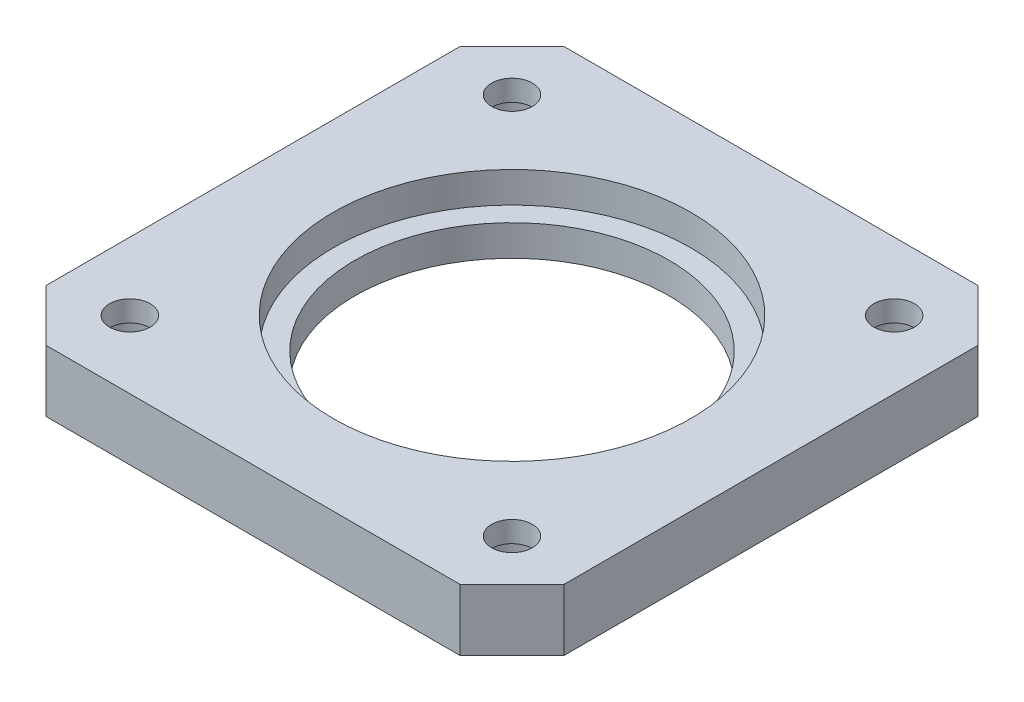
ISO-10303-21;
HEADER;
FILE_DESCRIPTION(('STEP AP214'),'2;1');
FILE_NAME('part.step','',(''),(''),'','','');
FILE_SCHEMA(('AUTOMOTIVE_DESIGN { 1 0 10303 214 1 1 1 1 }'));
ENDSEC;
DATA;
#1=APPLICATION_CONTEXT('core data for automotive mechanical design processes');
#2=APPLICATION_PROTOCOL_DEFINITION('international standard','automotive_design',2000,#1);
#3=PRODUCT_CONTEXT('',#1,'mechanical');
#4=PRODUCT('Part','Part','',(#3));
#5=PRODUCT_RELATED_PRODUCT_CATEGORY('part','',(#4));
#6=PRODUCT_DEFINITION_FORMATION('','',#4);
#7=PRODUCT_DEFINITION_CONTEXT('part definition',#1,'design');
#8=PRODUCT_DEFINITION('design','',#6,#7);
#9=PRODUCT_DEFINITION_SHAPE('','',#8);
#10=(LENGTH_UNIT() NAMED_UNIT(*) SI_UNIT(.MILLI.,.METRE.));
#11=(NAMED_UNIT(*) PLANE_ANGLE_UNIT() SI_UNIT($,.RADIAN.));
#12=(NAMED_UNIT(*) SI_UNIT($,.STERADIAN.) SOLID_ANGLE_UNIT());
#13=UNCERTAINTY_MEASURE_WITH_UNIT(LENGTH_MEASURE(1.E-05),#10,'distance_accuracy_value','');
#14=(GEOMETRIC_REPRESENTATION_CONTEXT(3) GLOBAL_UNCERTAINTY_ASSIGNED_CONTEXT((#13)) GLOBAL_UNIT_ASSIGNED_CONTEXT((#10,
#11,#12)) REPRESENTATION_CONTEXT('',''));
#15=CARTESIAN_POINT('',(0.,0.,0.));
#16=DIRECTION('',(0.,0.,1.));
#17=DIRECTION('',(1.,0.,0.));
#18=AXIS2_PLACEMENT_3D('',#15,#16,#17);
#19=CARTESIAN_POINT('',(5.5,5.,-5.5));
#20=DIRECTION('',(0.,-1.,0.));
#21=DIRECTION('',(0.,0.,-1.));
#22=AXIS2_PLACEMENT_3D('',#19,#20,#21);
#23=CYLINDRICAL_SURFACE('',#22,1.65);
#24=CARTESIAN_POINT('',(5.5,5.,-5.5));
#25=DIRECTION('',(0.,1.,0.));
#26=DIRECTION('',(0.,0.,1.));
#27=AXIS2_PLACEMENT_3D('',#24,#25,#26);
#28=CIRCLE('',#27,1.65);
#29=CARTESIAN_POINT('',(5.5,5.,-3.85));
#30=VERTEX_POINT('',#29);
#31=EDGE_CURVE('E235',#30,#30,#28,.T.);
#32=ORIENTED_EDGE('',*,*,#31,.T.);
#33=EDGE_LOOP('',(#32));
#34=FACE_BOUND('',#33,.T.);
#35=CARTESIAN_POINT('',(5.5,3.3,-5.5));
#36=DIRECTION('',(0.,-1.,0.));
#37=DIRECTION('',(0.,0.,-1.));
#38=AXIS2_PLACEMENT_3D('',#35,#36,#37);
#39=CIRCLE('',#38,1.65);
#40=CARTESIAN_POINT('',(5.5,3.3,-7.15));
#41=VERTEX_POINT('',#40);
#42=EDGE_CURVE('E44',#41,#41,#39,.T.);
#43=ORIENTED_EDGE('',*,*,#42,.T.);
#44=EDGE_LOOP('',(#43));
#45=FACE_BOUND('',#44,.T.);
#46=ADVANCED_FACE('F39',(#34,#45),#23,.F.);
#47=CARTESIAN_POINT('',(36.5,5.,-5.5));
#48=DIRECTION('',(0.,-1.,0.));
#49=DIRECTION('',(0.,0.,-1.));
#50=AXIS2_PLACEMENT_3D('',#47,#48,#49);
#51=CYLINDRICAL_SURFACE('',#50,1.65);
#52=CARTESIAN_POINT('',(36.5,5.,-5.5));
#53=DIRECTION('',(0.,1.,0.));
#54=DIRECTION('',(0.,0.,1.));
#55=AXIS2_PLACEMENT_3D('',#52,#53,#54);
#56=CIRCLE('',#55,1.65);
#57=CARTESIAN_POINT('',(36.5,5.,-3.85));
#58=VERTEX_POINT('',#57);
#59=EDGE_CURVE('E232',#58,#58,#56,.T.);
#60=ORIENTED_EDGE('',*,*,#59,.T.);
#61=EDGE_LOOP('',(#60));
#62=FACE_BOUND('',#61,.T.);
#63=CARTESIAN_POINT('',(36.5,3.3,-5.5));
#64=DIRECTION('',(0.,-1.,0.));
#65=DIRECTION('',(0.,0.,-1.));
#66=AXIS2_PLACEMENT_3D('',#63,#64,#65);
#67=CIRCLE('',#66,1.65);
#68=CARTESIAN_POINT('',(36.5,3.3,-7.15));
#69=VERTEX_POINT('',#68);
#70=EDGE_CURVE('E200',#69,#69,#67,.T.);
#71=ORIENTED_EDGE('',*,*,#70,.T.);
#72=EDGE_LOOP('',(#71));
#73=FACE_BOUND('',#72,.T.);
#74=ADVANCED_FACE('F268',(#62,#73),#51,.F.);
#75=CARTESIAN_POINT('',(36.4999999999999,5.,-36.5));
#76=DIRECTION('',(0.,-1.,0.));
#77=DIRECTION('',(0.,0.,-1.));
#78=AXIS2_PLACEMENT_3D('',#75,#76,#77);
#79=CYLINDRICAL_SURFACE('',#78,1.65);
#80=CARTESIAN_POINT('',(36.4999999999999,5.,-36.5));
#81=DIRECTION('',(0.,1.,0.));
#82=DIRECTION('',(0.,0.,1.));
#83=AXIS2_PLACEMENT_3D('',#80,#81,#82);
#84=CIRCLE('',#83,1.65);
#85=CARTESIAN_POINT('',(36.4999999999999,5.,-34.85));
#86=VERTEX_POINT('',#85);
#87=EDGE_CURVE('E229',#86,#86,#84,.T.);
#88=ORIENTED_EDGE('',*,*,#87,.T.);
#89=EDGE_LOOP('',(#88));
#90=FACE_BOUND('',#89,.T.);
#91=CARTESIAN_POINT('',(36.4999999999999,3.3,-36.5));
#92=DIRECTION('',(0.,-1.,0.));
#93=DIRECTION('',(0.,0.,-1.));
#94=AXIS2_PLACEMENT_3D('',#91,#92,#93);
#95=CIRCLE('',#94,1.65);
#96=CARTESIAN_POINT('',(36.4999999999999,3.3,-38.15));
#97=VERTEX_POINT('',#96);
#98=EDGE_CURVE('E197',#97,#97,#95,.T.);
#99=ORIENTED_EDGE('',*,*,#98,.T.);
#100=EDGE_LOOP('',(#99));
#101=FACE_BOUND('',#100,.T.);
#102=ADVANCED_FACE('F275',(#90,#101),#79,.F.);
#103=CARTESIAN_POINT('',(5.49999999999988,5.,-36.5));
#104=DIRECTION('',(0.,-1.,0.));
#105=DIRECTION('',(0.,0.,-1.));
#106=AXIS2_PLACEMENT_3D('',#103,#104,#105);
#107=CYLINDRICAL_SURFACE('',#106,1.65);
#108=CARTESIAN_POINT('',(5.49999999999988,5.,-36.5));
#109=DIRECTION('',(0.,1.,0.));
#110=DIRECTION('',(0.,0.,1.));
#111=AXIS2_PLACEMENT_3D('',#108,#109,#110);
#112=CIRCLE('',#111,1.65);
#113=CARTESIAN_POINT('',(5.49999999999988,5.,-34.85));
#114=VERTEX_POINT('',#113);
#115=EDGE_CURVE('E226',#114,#114,#112,.T.);
#116=ORIENTED_EDGE('',*,*,#115,.T.);
#117=EDGE_LOOP('',(#116));
#118=FACE_BOUND('',#117,.T.);
#119=CARTESIAN_POINT('',(5.49999999999988,3.3,-36.5));
#120=DIRECTION('',(0.,-1.,0.));
#121=DIRECTION('',(0.,0.,-1.));
#122=AXIS2_PLACEMENT_3D('',#119,#120,#121);
#123=CIRCLE('',#122,1.65);
#124=CARTESIAN_POINT('',(5.49999999999988,3.3,-38.15));
#125=VERTEX_POINT('',#124);
#126=EDGE_CURVE('E194',#125,#125,#123,.T.);
#127=ORIENTED_EDGE('',*,*,#126,.T.);
#128=EDGE_LOOP('',(#127));
#129=FACE_BOUND('',#128,.T.);
#130=ADVANCED_FACE('F347',(#118,#129),#107,.F.);
#131=CARTESIAN_POINT('',(21.,5.,-21.));
#132=DIRECTION('',(0.,-1.,0.));
#133=DIRECTION('',(0.,0.,-1.));
#134=AXIS2_PLACEMENT_3D('',#131,#132,#133);
#135=CYLINDRICAL_SURFACE('',#134,12.75);
#136=CARTESIAN_POINT('',(21.,0.,-21.));
#137=DIRECTION('',(0.,1.,0.));
#138=DIRECTION('',(0.,0.,1.));
#139=AXIS2_PLACEMENT_3D('',#136,#137,#138);
#140=CIRCLE('',#139,12.75);
#141=CARTESIAN_POINT('',(21.,0.,-8.24999999999999));
#142=VERTEX_POINT('',#141);
#143=EDGE_CURVE('E148',#142,#142,#140,.T.);
#144=ORIENTED_EDGE('',*,*,#143,.F.);
#145=EDGE_LOOP('',(#144));
#146=FACE_BOUND('',#145,.T.);
#147=CARTESIAN_POINT('',(21.,2.5,-21.));
#148=DIRECTION('',(0.,1.,0.));
#149=DIRECTION('',(0.,0.,1.));
#150=AXIS2_PLACEMENT_3D('',#147,#148,#149);
#151=CIRCLE('',#150,12.75);
#152=CARTESIAN_POINT('',(21.,2.5,-8.24999999999999));
#153=VERTEX_POINT('',#152);
#154=EDGE_CURVE('E145',#153,#153,#151,.T.);
#155=ORIENTED_EDGE('',*,*,#154,.T.);
#156=EDGE_LOOP('',(#155));
#157=FACE_BOUND('',#156,.T.);
#158=ADVANCED_FACE('F282',(#146,#157),#135,.F.);
#159=CARTESIAN_POINT('',(0.,5.,0.));
#160=DIRECTION('',(0.,-1.,0.));
#161=DIRECTION('',(0.,0.,-1.));
#162=AXIS2_PLACEMENT_3D('',#159,#160,#161);
#163=PLANE('',#162);
#164=CARTESIAN_POINT('',(21.,5.,-21.));
#165=DIRECTION('',(0.,1.,0.));
#166=DIRECTION('',(0.,0.,1.));
#167=AXIS2_PLACEMENT_3D('',#164,#165,#166);
#168=CIRCLE('',#167,14.5);
#169=CARTESIAN_POINT('',(21.,5.,-6.49999999999999));
#170=VERTEX_POINT('',#169);
#171=EDGE_CURVE('E220',#170,#170,#168,.T.);
#172=ORIENTED_EDGE('',*,*,#171,.F.);
#173=EDGE_LOOP('',(#172));
#174=FACE_BOUND('',#173,.T.);
#175=DIRECTION('',(0.,0.,-1.));
#176=VECTOR('',#175,1.);
#177=CARTESIAN_POINT('',(42.,5.,0.));
#178=LINE('',#177,#176);
#179=CARTESIAN_POINT('',(42.,5.,-4.2));
#180=VERTEX_POINT('',#179);
#181=CARTESIAN_POINT('',(42.,5.,-37.8));
#182=VERTEX_POINT('',#181);
#183=EDGE_CURVE('E240',#180,#182,#178,.T.);
#184=ORIENTED_EDGE('',*,*,#183,.T.);
#185=DIRECTION('',(0.707106781186546,0.,0.707106781186549));
#186=VECTOR('',#185,1.);
#187=CARTESIAN_POINT('',(37.8,5.,-42.));
#188=LINE('',#187,#186);
#189=CARTESIAN_POINT('',(37.8,5.,-42.));
#190=VERTEX_POINT('',#189);
#191=EDGE_CURVE('E163',#182,#190,#188,.F.);
#192=ORIENTED_EDGE('',*,*,#191,.T.);
#193=DIRECTION('',(-1.,0.,0.));
#194=VECTOR('',#193,1.);
#195=CARTESIAN_POINT('',(0.,5.,-42.));
#196=LINE('',#195,#194);
#197=CARTESIAN_POINT('',(4.20000000000002,5.,-42.));
#198=VERTEX_POINT('',#197);
#199=EDGE_CURVE('E129',#190,#198,#196,.T.);
#200=ORIENTED_EDGE('',*,*,#199,.T.);
#201=DIRECTION('',(0.707106781186549,0.,-0.707106781186546));
#202=VECTOR('',#201,1.);
#203=CARTESIAN_POINT('',(0.,5.,-37.8));
#204=LINE('',#203,#202);
#205=CARTESIAN_POINT('',(0.,5.,-37.8));
#206=VERTEX_POINT('',#205);
#207=EDGE_CURVE('E161',#198,#206,#204,.F.);
#208=ORIENTED_EDGE('',*,*,#207,.T.);
#209=DIRECTION('',(0.,0.,1.));
#210=VECTOR('',#209,1.);
#211=CARTESIAN_POINT('',(0.,5.,0.));
#212=LINE('',#211,#210);
#213=CARTESIAN_POINT('',(0.,5.,-4.20000000000001));
#214=VERTEX_POINT('',#213);
#215=EDGE_CURVE('E136',#206,#214,#212,.T.);
#216=ORIENTED_EDGE('',*,*,#215,.T.);
#217=DIRECTION('',(-0.707106781186546,0.,-0.707106781186549));
#218=VECTOR('',#217,1.);
#219=CARTESIAN_POINT('',(4.2,5.,0.));
#220=LINE('',#219,#218);
#221=CARTESIAN_POINT('',(4.2,5.,0.));
#222=VERTEX_POINT('',#221);
#223=EDGE_CURVE('E64',#214,#222,#220,.F.);
#224=ORIENTED_EDGE('',*,*,#223,.T.);
#225=DIRECTION('',(1.,0.,0.));
#226=VECTOR('',#225,1.);
#227=CARTESIAN_POINT('',(0.,5.,0.));
#228=LINE('',#227,#226);
#229=CARTESIAN_POINT('',(37.8,5.,0.));
#230=VERTEX_POINT('',#229);
#231=EDGE_CURVE('E139',#222,#230,#228,.T.);
#232=ORIENTED_EDGE('',*,*,#231,.T.);
#233=DIRECTION('',(-0.707106781186549,0.,0.707106781186546));
#234=VECTOR('',#233,1.);
#235=CARTESIAN_POINT('',(42.,5.,-4.2));
#236=LINE('',#235,#234);
#237=EDGE_CURVE('E158',#230,#180,#236,.F.);
#238=ORIENTED_EDGE('',*,*,#237,.T.);
#239=EDGE_LOOP('',(#184,#192,#200,#208,#216,#224,#232,#238));
#240=FACE_BOUND('',#239,.T.);
#241=ORIENTED_EDGE('',*,*,#31,.F.);
#242=EDGE_LOOP('',(#241));
#243=FACE_BOUND('',#242,.T.);
#244=ORIENTED_EDGE('',*,*,#59,.F.);
#245=EDGE_LOOP('',(#244));
#246=FACE_BOUND('',#245,.T.);
#247=ORIENTED_EDGE('',*,*,#87,.F.);
#248=EDGE_LOOP('',(#247));
#249=FACE_BOUND('',#248,.T.);
#250=ORIENTED_EDGE('',*,*,#115,.F.);
#251=EDGE_LOOP('',(#250));
#252=FACE_BOUND('',#251,.T.);
#253=ADVANCED_FACE('F253',(#174,#240,#243,#246,#249,#252),#163,.F.);
#254=CARTESIAN_POINT('',(0.,0.,0.));
#255=DIRECTION('',(0.,-1.,0.));
#256=DIRECTION('',(0.,0.,-1.));
#257=AXIS2_PLACEMENT_3D('',#254,#255,#256);
#258=PLANE('',#257);
#259=CARTESIAN_POINT('',(5.49999999999988,0.,-36.5));
#260=DIRECTION('',(0.,-1.,0.));
#261=DIRECTION('',(0.,0.,-1.));
#262=AXIS2_PLACEMENT_3D('',#259,#260,#261);
#263=CIRCLE('',#262,3.);
#264=CARTESIAN_POINT('',(5.49999999999988,0.,-39.5));
#265=VERTEX_POINT('',#264);
#266=EDGE_CURVE('E296',#265,#265,#263,.T.);
#267=ORIENTED_EDGE('',*,*,#266,.F.);
#268=EDGE_LOOP('',(#267));
#269=FACE_BOUND('',#268,.T.);
#270=CARTESIAN_POINT('',(36.4999999999999,0.,-36.5));
#271=DIRECTION('',(0.,-1.,0.));
#272=DIRECTION('',(0.,0.,-1.));
#273=AXIS2_PLACEMENT_3D('',#270,#271,#272);
#274=CIRCLE('',#273,3.);
#275=CARTESIAN_POINT('',(36.4999999999999,0.,-39.5));
#276=VERTEX_POINT('',#275);
#277=EDGE_CURVE('E300',#276,#276,#274,.T.);
#278=ORIENTED_EDGE('',*,*,#277,.F.);
#279=EDGE_LOOP('',(#278));
#280=FACE_BOUND('',#279,.T.);
#281=CARTESIAN_POINT('',(36.5,0.,-5.5));
#282=DIRECTION('',(0.,-1.,0.));
#283=DIRECTION('',(0.,0.,-1.));
#284=AXIS2_PLACEMENT_3D('',#281,#282,#283);
#285=CIRCLE('',#284,3.);
#286=CARTESIAN_POINT('',(36.5,0.,-8.5));
#287=VERTEX_POINT('',#286);
#288=EDGE_CURVE('E304',#287,#287,#285,.T.);
#289=ORIENTED_EDGE('',*,*,#288,.F.);
#290=EDGE_LOOP('',(#289));
#291=FACE_BOUND('',#290,.T.);
#292=CARTESIAN_POINT('',(5.5,0.,-5.5));
#293=DIRECTION('',(0.,-1.,0.));
#294=DIRECTION('',(0.,0.,-1.));
#295=AXIS2_PLACEMENT_3D('',#292,#293,#294);
#296=CIRCLE('',#295,3.);
#297=CARTESIAN_POINT('',(5.5,0.,-8.5));
#298=VERTEX_POINT('',#297);
#299=EDGE_CURVE('E308',#298,#298,#296,.T.);
#300=ORIENTED_EDGE('',*,*,#299,.F.);
#301=EDGE_LOOP('',(#300));
#302=FACE_BOUND('',#301,.T.);
#303=CARTESIAN_POINT('',(21.,0.,-38.));
#304=DIRECTION('',(0.,-1.,0.));
#305=DIRECTION('',(0.,0.,-1.));
#306=AXIS2_PLACEMENT_3D('',#303,#304,#305);
#307=CIRCLE('',#306,2.45000000000001);
#308=CARTESIAN_POINT('',(21.,0.,-40.45));
#309=VERTEX_POINT('',#308);
#310=EDGE_CURVE('E186',#309,#309,#307,.F.);
#311=ORIENTED_EDGE('',*,*,#310,.T.);
#312=EDGE_LOOP('',(#311));
#313=FACE_BOUND('',#312,.T.);
#314=CARTESIAN_POINT('',(4.,0.,-21.));
#315=DIRECTION('',(0.,-1.,0.));
#316=DIRECTION('',(0.,0.,-1.));
#317=AXIS2_PLACEMENT_3D('',#314,#315,#316);
#318=CIRCLE('',#317,2.45000000000001);
#319=CARTESIAN_POINT('',(4.,0.,-23.45));
#320=VERTEX_POINT('',#319);
#321=EDGE_CURVE('E183',#320,#320,#318,.F.);
#322=ORIENTED_EDGE('',*,*,#321,.T.);
#323=EDGE_LOOP('',(#322));
#324=FACE_BOUND('',#323,.T.);
#325=CARTESIAN_POINT('',(38.,0.,-21.));
#326=DIRECTION('',(0.,-1.,0.));
#327=DIRECTION('',(0.,0.,-1.));
#328=AXIS2_PLACEMENT_3D('',#325,#326,#327);
#329=CIRCLE('',#328,2.45000000000001);
#330=CARTESIAN_POINT('',(38.,0.,-23.45));
#331=VERTEX_POINT('',#330);
#332=EDGE_CURVE('E180',#331,#331,#329,.F.);
#333=ORIENTED_EDGE('',*,*,#332,.T.);
#334=EDGE_LOOP('',(#333));
#335=FACE_BOUND('',#334,.T.);
#336=CARTESIAN_POINT('',(21.,0.,-4.));
#337=DIRECTION('',(0.,-1.,0.));
#338=DIRECTION('',(0.,0.,-1.));
#339=AXIS2_PLACEMENT_3D('',#336,#337,#338);
#340=CIRCLE('',#339,2.45000000000001);
#341=CARTESIAN_POINT('',(21.,0.,-6.45000000000001));
#342=VERTEX_POINT('',#341);
#343=EDGE_CURVE('E177',#342,#342,#340,.F.);
#344=ORIENTED_EDGE('',*,*,#343,.T.);
#345=EDGE_LOOP('',(#344));
#346=FACE_BOUND('',#345,.T.);
#347=DIRECTION('',(-1.,0.,0.));
#348=VECTOR('',#347,1.);
#349=CARTESIAN_POINT('',(0.,0.,-42.));
#350=LINE('',#349,#348);
#351=CARTESIAN_POINT('',(37.8,0.,-42.));
#352=VERTEX_POINT('',#351);
#353=CARTESIAN_POINT('',(4.20000000000002,0.,-42.));
#354=VERTEX_POINT('',#353);
#355=EDGE_CURVE('E126',#352,#354,#350,.T.);
#356=ORIENTED_EDGE('',*,*,#355,.F.);
#357=DIRECTION('',(-0.707106781186546,0.,-0.707106781186549));
#358=VECTOR('',#357,1.);
#359=CARTESIAN_POINT('',(39.9000000000001,0.,-39.8999999999999));
#360=LINE('',#359,#358);
#361=CARTESIAN_POINT('',(42.,0.,-37.8));
#362=VERTEX_POINT('',#361);
#363=EDGE_CURVE('E109',#352,#362,#360,.F.);
#364=ORIENTED_EDGE('',*,*,#363,.T.);
#365=DIRECTION('',(0.,0.,-1.));
#366=VECTOR('',#365,1.);
#367=CARTESIAN_POINT('',(42.,0.,0.));
#368=LINE('',#367,#366);
#369=CARTESIAN_POINT('',(42.,0.,-4.2));
#370=VERTEX_POINT('',#369);
#371=EDGE_CURVE('E137',#370,#362,#368,.T.);
#372=ORIENTED_EDGE('',*,*,#371,.F.);
#373=DIRECTION('',(0.707106781186549,0.,-0.707106781186546));
#374=VECTOR('',#373,1.);
#375=CARTESIAN_POINT('',(18.8999999999999,0.,18.9));
#376=LINE('',#375,#374);
#377=CARTESIAN_POINT('',(37.8,0.,0.));
#378=VERTEX_POINT('',#377);
#379=EDGE_CURVE('E130',#370,#378,#376,.F.);
#380=ORIENTED_EDGE('',*,*,#379,.T.);
#381=DIRECTION('',(1.,0.,0.));
#382=VECTOR('',#381,1.);
#383=CARTESIAN_POINT('',(0.,0.,0.));
#384=LINE('',#383,#382);
#385=CARTESIAN_POINT('',(4.2,0.,0.));
#386=VERTEX_POINT('',#385);
#387=EDGE_CURVE('E141',#386,#378,#384,.T.);
#388=ORIENTED_EDGE('',*,*,#387,.F.);
#389=DIRECTION('',(0.707106781186546,0.,0.707106781186549));
#390=VECTOR('',#389,1.);
#391=CARTESIAN_POINT('',(2.10000000000001,0.,-2.1));
#392=LINE('',#391,#390);
#393=CARTESIAN_POINT('',(0.,0.,-4.20000000000001));
#394=VERTEX_POINT('',#393);
#395=EDGE_CURVE('E152',#386,#394,#392,.F.);
#396=ORIENTED_EDGE('',*,*,#395,.T.);
#397=DIRECTION('',(0.,0.,1.));
#398=VECTOR('',#397,1.);
#399=CARTESIAN_POINT('',(0.,0.,0.));
#400=LINE('',#399,#398);
#401=CARTESIAN_POINT('',(0.,0.,-37.8));
#402=VERTEX_POINT('',#401);
#403=EDGE_CURVE('E237',#402,#394,#400,.T.);
#404=ORIENTED_EDGE('',*,*,#403,.F.);
#405=DIRECTION('',(-0.707106781186549,0.,0.707106781186546));
#406=VECTOR('',#405,1.);
#407=CARTESIAN_POINT('',(-18.9,0.,-18.9000000000001));
#408=LINE('',#407,#406);
#409=EDGE_CURVE('E120',#402,#354,#408,.F.);
#410=ORIENTED_EDGE('',*,*,#409,.T.);
#411=EDGE_LOOP('',(#356,#364,#372,#380,#388,#396,#404,#410));
#412=FACE_BOUND('',#411,.T.);
#413=ORIENTED_EDGE('',*,*,#143,.T.);
#414=EDGE_LOOP('',(#413));
#415=FACE_BOUND('',#414,.T.);
#416=ADVANCED_FACE('F133',(#269,#280,#291,#302,#313,#324,#335,#346,#412,#415),#258,.T.);
#417=CARTESIAN_POINT('',(0.,5.,0.));
#418=DIRECTION('',(1.,0.,0.));
#419=DIRECTION('',(0.,0.,-1.));
#420=AXIS2_PLACEMENT_3D('',#417,#418,#419);
#421=PLANE('',#420);
#422=ORIENTED_EDGE('',*,*,#215,.F.);
#423=DIRECTION('',(0.,-1.,0.));
#424=VECTOR('',#423,1.);
#425=CARTESIAN_POINT('',(0.,5.,-37.8));
#426=LINE('',#425,#424);
#427=EDGE_CURVE('E167',#206,#402,#426,.T.);
#428=ORIENTED_EDGE('',*,*,#427,.T.);
#429=ORIENTED_EDGE('',*,*,#403,.T.);
#430=DIRECTION('',(0.,1.,0.));
#431=VECTOR('',#430,1.);
#432=CARTESIAN_POINT('',(0.,5.,-4.20000000000002));
#433=LINE('',#432,#431);
#434=EDGE_CURVE('E165',#394,#214,#433,.T.);
#435=ORIENTED_EDGE('',*,*,#434,.T.);
#436=EDGE_LOOP('',(#422,#428,#429,#435));
#437=FACE_BOUND('',#436,.T.);
#438=ADVANCED_FACE('F265',(#437),#421,.F.);
#439=CARTESIAN_POINT('',(0.,5.,0.));
#440=DIRECTION('',(0.,0.,-1.));
#441=DIRECTION('',(-1.,0.,0.));
#442=AXIS2_PLACEMENT_3D('',#439,#440,#441);
#443=PLANE('',#442);
#444=ORIENTED_EDGE('',*,*,#231,.F.);
#445=DIRECTION('',(0.,-1.,0.));
#446=VECTOR('',#445,1.);
#447=CARTESIAN_POINT('',(4.2,5.,0.));
#448=LINE('',#447,#446);
#449=EDGE_CURVE('E171',#222,#386,#448,.T.);
#450=ORIENTED_EDGE('',*,*,#449,.T.);
#451=ORIENTED_EDGE('',*,*,#387,.T.);
#452=DIRECTION('',(0.,1.,0.));
#453=VECTOR('',#452,1.);
#454=CARTESIAN_POINT('',(37.8,5.,0.));
#455=LINE('',#454,#453);
#456=EDGE_CURVE('E57',#378,#230,#455,.T.);
#457=ORIENTED_EDGE('',*,*,#456,.T.);
#458=EDGE_LOOP('',(#444,#450,#451,#457));
#459=FACE_BOUND('',#458,.T.);
#460=ADVANCED_FACE('F246',(#459),#443,.F.);
#461=CARTESIAN_POINT('',(42.,5.,0.));
#462=DIRECTION('',(-1.,0.,0.));
#463=DIRECTION('',(0.,0.,1.));
#464=AXIS2_PLACEMENT_3D('',#461,#462,#463);
#465=PLANE('',#464);
#466=ORIENTED_EDGE('',*,*,#371,.T.);
#467=DIRECTION('',(0.,1.,0.));
#468=VECTOR('',#467,1.);
#469=CARTESIAN_POINT('',(42.,5.,-37.8));
#470=LINE('',#469,#468);
#471=EDGE_CURVE('E114',#362,#182,#470,.T.);
#472=ORIENTED_EDGE('',*,*,#471,.T.);
#473=ORIENTED_EDGE('',*,*,#183,.F.);
#474=DIRECTION('',(0.,-1.,0.));
#475=VECTOR('',#474,1.);
#476=CARTESIAN_POINT('',(42.,5.,-4.2));
#477=LINE('',#476,#475);
#478=EDGE_CURVE('E119',#180,#370,#477,.T.);
#479=ORIENTED_EDGE('',*,*,#478,.T.);
#480=EDGE_LOOP('',(#466,#472,#473,#479));
#481=FACE_BOUND('',#480,.T.);
#482=ADVANCED_FACE('F256',(#481),#465,.F.);
#483=CARTESIAN_POINT('',(0.,5.,-42.));
#484=DIRECTION('',(0.,0.,1.));
#485=DIRECTION('',(1.,0.,0.));
#486=AXIS2_PLACEMENT_3D('',#483,#484,#485);
#487=PLANE('',#486);
#488=ORIENTED_EDGE('',*,*,#199,.F.);
#489=DIRECTION('',(0.,-1.,0.));
#490=VECTOR('',#489,1.);
#491=CARTESIAN_POINT('',(37.8,5.,-42.));
#492=LINE('',#491,#490);
#493=EDGE_CURVE('E113',#190,#352,#492,.T.);
#494=ORIENTED_EDGE('',*,*,#493,.T.);
#495=ORIENTED_EDGE('',*,*,#355,.T.);
#496=DIRECTION('',(0.,1.,0.));
#497=VECTOR('',#496,1.);
#498=CARTESIAN_POINT('',(4.20000000000002,5.,-42.));
#499=LINE('',#498,#497);
#500=EDGE_CURVE('E131',#354,#198,#499,.T.);
#501=ORIENTED_EDGE('',*,*,#500,.T.);
#502=EDGE_LOOP('',(#488,#494,#495,#501));
#503=FACE_BOUND('',#502,.T.);
#504=ADVANCED_FACE('F125',(#503),#487,.F.);
#505=CARTESIAN_POINT('',(21.,2.5,-21.));
#506=DIRECTION('',(0.,1.,0.));
#507=DIRECTION('',(0.,0.,1.));
#508=AXIS2_PLACEMENT_3D('',#505,#506,#507);
#509=CYLINDRICAL_SURFACE('',#508,14.5);
#510=CARTESIAN_POINT('',(21.,2.5,-21.));
#511=DIRECTION('',(0.,1.,0.));
#512=DIRECTION('',(0.,0.,1.));
#513=AXIS2_PLACEMENT_3D('',#510,#511,#512);
#514=CIRCLE('',#513,14.5);
#515=CARTESIAN_POINT('',(21.,2.5,-6.49999999999999));
#516=VERTEX_POINT('',#515);
#517=EDGE_CURVE('E149',#516,#516,#514,.T.);
#518=ORIENTED_EDGE('',*,*,#517,.F.);
#519=EDGE_LOOP('',(#518));
#520=FACE_BOUND('',#519,.T.);
#521=ORIENTED_EDGE('',*,*,#171,.T.);
#522=EDGE_LOOP('',(#521));
#523=FACE_BOUND('',#522,.T.);
#524=ADVANCED_FACE('F263',(#520,#523),#509,.F.);
#525=CARTESIAN_POINT('',(21.,2.5,-21.));
#526=DIRECTION('',(0.,1.,0.));
#527=DIRECTION('',(0.,0.,1.));
#528=AXIS2_PLACEMENT_3D('',#525,#526,#527);
#529=PLANE('',#528);
#530=ORIENTED_EDGE('',*,*,#154,.F.);
#531=EDGE_LOOP('',(#530));
#532=FACE_BOUND('',#531,.T.);
#533=ORIENTED_EDGE('',*,*,#517,.T.);
#534=EDGE_LOOP('',(#533));
#535=FACE_BOUND('',#534,.T.);
#536=ADVANCED_FACE('F338',(#532,#535),#529,.T.);
#537=CARTESIAN_POINT('',(37.8,5.,-42.));
#538=DIRECTION('',(-0.707106781186549,0.,0.707106781186546));
#539=DIRECTION('',(0.,-1.,0.));
#540=AXIS2_PLACEMENT_3D('',#537,#538,#539);
#541=PLANE('',#540);
#542=ORIENTED_EDGE('',*,*,#191,.F.);
#543=ORIENTED_EDGE('',*,*,#471,.F.);
#544=ORIENTED_EDGE('',*,*,#363,.F.);
#545=ORIENTED_EDGE('',*,*,#493,.F.);
#546=EDGE_LOOP('',(#542,#543,#544,#545));
#547=FACE_BOUND('',#546,.T.);
#548=ADVANCED_FACE('F112',(#547),#541,.F.);
#549=CARTESIAN_POINT('',(0.,5.,-37.8));
#550=DIRECTION('',(0.707106781186546,0.,0.707106781186549));
#551=DIRECTION('',(0.,-1.,0.));
#552=AXIS2_PLACEMENT_3D('',#549,#550,#551);
#553=PLANE('',#552);
#554=ORIENTED_EDGE('',*,*,#207,.F.);
#555=ORIENTED_EDGE('',*,*,#500,.F.);
#556=ORIENTED_EDGE('',*,*,#409,.F.);
#557=ORIENTED_EDGE('',*,*,#427,.F.);
#558=EDGE_LOOP('',(#554,#555,#556,#557));
#559=FACE_BOUND('',#558,.T.);
#560=ADVANCED_FACE('F443',(#559),#553,.F.);
#561=CARTESIAN_POINT('',(4.2,5.,0.));
#562=DIRECTION('',(0.707106781186549,0.,-0.707106781186546));
#563=DIRECTION('',(0.,-1.,0.));
#564=AXIS2_PLACEMENT_3D('',#561,#562,#563);
#565=PLANE('',#564);
#566=ORIENTED_EDGE('',*,*,#223,.F.);
#567=ORIENTED_EDGE('',*,*,#434,.F.);
#568=ORIENTED_EDGE('',*,*,#395,.F.);
#569=ORIENTED_EDGE('',*,*,#449,.F.);
#570=EDGE_LOOP('',(#566,#567,#568,#569));
#571=FACE_BOUND('',#570,.T.);
#572=ADVANCED_FACE('F334',(#571),#565,.F.);
#573=CARTESIAN_POINT('',(42.,5.,-4.2));
#574=DIRECTION('',(-0.707106781186546,0.,-0.707106781186549));
#575=DIRECTION('',(0.,-1.,0.));
#576=AXIS2_PLACEMENT_3D('',#573,#574,#575);
#577=PLANE('',#576);
#578=ORIENTED_EDGE('',*,*,#237,.F.);
#579=ORIENTED_EDGE('',*,*,#456,.F.);
#580=ORIENTED_EDGE('',*,*,#379,.F.);
#581=ORIENTED_EDGE('',*,*,#478,.F.);
#582=EDGE_LOOP('',(#578,#579,#580,#581));
#583=FACE_BOUND('',#582,.T.);
#584=ADVANCED_FACE('F250',(#583),#577,.F.);
#585=CARTESIAN_POINT('',(21.,3.2,-4.));
#586=DIRECTION('',(0.,-1.,0.));
#587=DIRECTION('',(0.,0.,-1.));
#588=AXIS2_PLACEMENT_3D('',#585,#586,#587);
#589=CYLINDRICAL_SURFACE('',#588,1.95);
#590=CARTESIAN_POINT('',(21.,0.500000000000016,-4.));
#591=DIRECTION('',(0.,-1.,0.));
#592=DIRECTION('',(0.,0.,-1.));
#593=AXIS2_PLACEMENT_3D('',#590,#591,#592);
#594=CIRCLE('',#593,1.95);
#595=CARTESIAN_POINT('',(21.,0.500000000000016,-5.94999999999999));
#596=VERTEX_POINT('',#595);
#597=EDGE_CURVE('E11',#596,#596,#594,.T.);
#598=ORIENTED_EDGE('',*,*,#597,.T.);
#599=EDGE_LOOP('',(#598));
#600=FACE_BOUND('',#599,.T.);
#601=CARTESIAN_POINT('',(21.,3.2,-4.));
#602=DIRECTION('',(0.,-1.,0.));
#603=DIRECTION('',(0.,0.,-1.));
#604=AXIS2_PLACEMENT_3D('',#601,#602,#603);
#605=CIRCLE('',#604,1.95);
#606=CARTESIAN_POINT('',(21.,3.2,-5.94999999999999));
#607=VERTEX_POINT('',#606);
#608=EDGE_CURVE('E205',#607,#607,#605,.T.);
#609=ORIENTED_EDGE('',*,*,#608,.F.);
#610=EDGE_LOOP('',(#609));
#611=FACE_BOUND('',#610,.T.);
#612=ADVANCED_FACE('F323',(#600,#611),#589,.F.);
#613=CARTESIAN_POINT('',(21.,3.2,-4.));
#614=DIRECTION('',(0.,-1.,0.));
#615=DIRECTION('',(0.,0.,-1.));
#616=AXIS2_PLACEMENT_3D('',#613,#614,#615);
#617=PLANE('',#616);
#618=ORIENTED_EDGE('',*,*,#608,.T.);
#619=EDGE_LOOP('',(#618));
#620=FACE_BOUND('',#619,.T.);
#621=ADVANCED_FACE('F326',(#620),#617,.T.);
#622=CARTESIAN_POINT('',(4.,3.2,-21.));
#623=DIRECTION('',(0.,-1.,0.));
#624=DIRECTION('',(0.,0.,-1.));
#625=AXIS2_PLACEMENT_3D('',#622,#623,#624);
#626=CYLINDRICAL_SURFACE('',#625,1.95);
#627=CARTESIAN_POINT('',(4.,0.500000000000014,-21.));
#628=DIRECTION('',(0.,-1.,0.));
#629=DIRECTION('',(0.,0.,-1.));
#630=AXIS2_PLACEMENT_3D('',#627,#628,#629);
#631=CIRCLE('',#630,1.95);
#632=CARTESIAN_POINT('',(4.,0.500000000000014,-22.95));
#633=VERTEX_POINT('',#632);
#634=EDGE_CURVE('E189',#633,#633,#631,.T.);
#635=ORIENTED_EDGE('',*,*,#634,.T.);
#636=EDGE_LOOP('',(#635));
#637=FACE_BOUND('',#636,.T.);
#638=CARTESIAN_POINT('',(4.,3.2,-21.));
#639=DIRECTION('',(0.,-1.,0.));
#640=DIRECTION('',(0.,0.,-1.));
#641=AXIS2_PLACEMENT_3D('',#638,#639,#640);
#642=CIRCLE('',#641,1.95);
#643=CARTESIAN_POINT('',(4.,3.2,-22.95));
#644=VERTEX_POINT('',#643);
#645=EDGE_CURVE('E209',#644,#644,#642,.T.);
#646=ORIENTED_EDGE('',*,*,#645,.F.);
#647=EDGE_LOOP('',(#646));
#648=FACE_BOUND('',#647,.T.);
#649=ADVANCED_FACE('F332',(#637,#648),#626,.F.);
#650=CARTESIAN_POINT('',(4.,3.2,-21.));
#651=DIRECTION('',(0.,-1.,0.));
#652=DIRECTION('',(0.,0.,-1.));
#653=AXIS2_PLACEMENT_3D('',#650,#651,#652);
#654=PLANE('',#653);
#655=ORIENTED_EDGE('',*,*,#645,.T.);
#656=EDGE_LOOP('',(#655));
#657=FACE_BOUND('',#656,.T.);
#658=ADVANCED_FACE('F389',(#657),#654,.T.);
#659=CARTESIAN_POINT('',(21.,3.2,-38.));
#660=DIRECTION('',(0.,-1.,0.));
#661=DIRECTION('',(0.,0.,-1.));
#662=AXIS2_PLACEMENT_3D('',#659,#660,#661);
#663=CYLINDRICAL_SURFACE('',#662,1.95);
#664=CARTESIAN_POINT('',(21.,0.500000000000016,-38.));
#665=DIRECTION('',(0.,-1.,0.));
#666=DIRECTION('',(0.,0.,-1.));
#667=AXIS2_PLACEMENT_3D('',#664,#665,#666);
#668=CIRCLE('',#667,1.95);
#669=CARTESIAN_POINT('',(21.,0.500000000000016,-39.95));
#670=VERTEX_POINT('',#669);
#671=EDGE_CURVE('E174',#670,#670,#668,.T.);
#672=ORIENTED_EDGE('',*,*,#671,.T.);
#673=EDGE_LOOP('',(#672));
#674=FACE_BOUND('',#673,.T.);
#675=CARTESIAN_POINT('',(21.,3.2,-38.));
#676=DIRECTION('',(0.,-1.,0.));
#677=DIRECTION('',(0.,0.,-1.));
#678=AXIS2_PLACEMENT_3D('',#675,#676,#677);
#679=CIRCLE('',#678,1.95);
#680=CARTESIAN_POINT('',(21.,3.2,-39.95));
#681=VERTEX_POINT('',#680);
#682=EDGE_CURVE('E214',#681,#681,#679,.T.);
#683=ORIENTED_EDGE('',*,*,#682,.F.);
#684=EDGE_LOOP('',(#683));
#685=FACE_BOUND('',#684,.T.);
#686=ADVANCED_FACE('F387',(#674,#685),#663,.F.);
#687=CARTESIAN_POINT('',(21.,3.2,-38.));
#688=DIRECTION('',(0.,-1.,0.));
#689=DIRECTION('',(0.,0.,-1.));
#690=AXIS2_PLACEMENT_3D('',#687,#688,#689);
#691=PLANE('',#690);
#692=ORIENTED_EDGE('',*,*,#682,.T.);
#693=EDGE_LOOP('',(#692));
#694=FACE_BOUND('',#693,.T.);
#695=ADVANCED_FACE('F385',(#694),#691,.T.);
#696=CARTESIAN_POINT('',(38.,3.2,-21.));
#697=DIRECTION('',(0.,-1.,0.));
#698=DIRECTION('',(0.,0.,-1.));
#699=AXIS2_PLACEMENT_3D('',#696,#697,#698);
#700=CYLINDRICAL_SURFACE('',#699,1.95);
#701=CARTESIAN_POINT('',(38.,0.500000000000016,-21.));
#702=DIRECTION('',(0.,-1.,0.));
#703=DIRECTION('',(0.,0.,-1.));
#704=AXIS2_PLACEMENT_3D('',#701,#702,#703);
#705=CIRCLE('',#704,1.95);
#706=CARTESIAN_POINT('',(38.,0.500000000000016,-22.95));
#707=VERTEX_POINT('',#706);
#708=EDGE_CURVE('E49',#707,#707,#705,.T.);
#709=ORIENTED_EDGE('',*,*,#708,.T.);
#710=EDGE_LOOP('',(#709));
#711=FACE_BOUND('',#710,.T.);
#712=CARTESIAN_POINT('',(38.,3.2,-21.));
#713=DIRECTION('',(0.,-1.,0.));
#714=DIRECTION('',(0.,0.,-1.));
#715=AXIS2_PLACEMENT_3D('',#712,#713,#714);
#716=CIRCLE('',#715,1.95);
#717=CARTESIAN_POINT('',(38.,3.2,-22.95));
#718=VERTEX_POINT('',#717);
#719=EDGE_CURVE('E223',#718,#718,#716,.T.);
#720=ORIENTED_EDGE('',*,*,#719,.F.);
#721=EDGE_LOOP('',(#720));
#722=FACE_BOUND('',#721,.T.);
#723=ADVANCED_FACE('F396',(#711,#722),#700,.F.);
#724=CARTESIAN_POINT('',(38.,3.2,-21.));
#725=DIRECTION('',(0.,-1.,0.));
#726=DIRECTION('',(0.,0.,-1.));
#727=AXIS2_PLACEMENT_3D('',#724,#725,#726);
#728=PLANE('',#727);
#729=ORIENTED_EDGE('',*,*,#719,.T.);
#730=EDGE_LOOP('',(#729));
#731=FACE_BOUND('',#730,.T.);
#732=ADVANCED_FACE('F419',(#731),#728,.T.);
#733=CARTESIAN_POINT('',(21.,0.500000000000016,-38.));
#734=DIRECTION('',(0.,-1.,0.));
#735=DIRECTION('',(0.,0.,-1.));
#736=AXIS2_PLACEMENT_3D('',#733,#734,#735);
#737=CONICAL_SURFACE('',#736,1.95,0.785398163397448);
#738=ORIENTED_EDGE('',*,*,#310,.F.);
#739=EDGE_LOOP('',(#738));
#740=FACE_BOUND('',#739,.T.);
#741=ORIENTED_EDGE('',*,*,#671,.F.);
#742=EDGE_LOOP('',(#741));
#743=FACE_BOUND('',#742,.T.);
#744=ADVANCED_FACE('F411',(#740,#743),#737,.F.);
#745=CARTESIAN_POINT('',(4.,0.500000000000014,-21.));
#746=DIRECTION('',(0.,-1.,0.));
#747=DIRECTION('',(0.,0.,-1.));
#748=AXIS2_PLACEMENT_3D('',#745,#746,#747);
#749=CONICAL_SURFACE('',#748,1.95,0.785398163397448);
#750=ORIENTED_EDGE('',*,*,#321,.F.);
#751=EDGE_LOOP('',(#750));
#752=FACE_BOUND('',#751,.T.);
#753=ORIENTED_EDGE('',*,*,#634,.F.);
#754=EDGE_LOOP('',(#753));
#755=FACE_BOUND('',#754,.T.);
#756=ADVANCED_FACE('F409',(#752,#755),#749,.F.);
#757=CARTESIAN_POINT('',(38.,0.500000000000016,-21.));
#758=DIRECTION('',(0.,-1.,0.));
#759=DIRECTION('',(0.,0.,-1.));
#760=AXIS2_PLACEMENT_3D('',#757,#758,#759);
#761=CONICAL_SURFACE('',#760,1.95,0.785398163397448);
#762=ORIENTED_EDGE('',*,*,#332,.F.);
#763=EDGE_LOOP('',(#762));
#764=FACE_BOUND('',#763,.T.);
#765=ORIENTED_EDGE('',*,*,#708,.F.);
#766=EDGE_LOOP('',(#765));
#767=FACE_BOUND('',#766,.T.);
#768=ADVANCED_FACE('F320',(#764,#767),#761,.F.);
#769=CARTESIAN_POINT('',(21.,0.500000000000016,-4.));
#770=DIRECTION('',(0.,-1.,0.));
#771=DIRECTION('',(0.,0.,-1.));
#772=AXIS2_PLACEMENT_3D('',#769,#770,#771);
#773=CONICAL_SURFACE('',#772,1.95,0.785398163397448);
#774=ORIENTED_EDGE('',*,*,#343,.F.);
#775=EDGE_LOOP('',(#774));
#776=FACE_BOUND('',#775,.T.);
#777=ORIENTED_EDGE('',*,*,#597,.F.);
#778=EDGE_LOOP('',(#777));
#779=FACE_BOUND('',#778,.T.);
#780=ADVANCED_FACE('F42',(#776,#779),#773,.F.);
#781=CARTESIAN_POINT('',(5.49999999999988,3.3,-36.5));
#782=DIRECTION('',(0.,-1.,0.));
#783=DIRECTION('',(0.,0.,-1.));
#784=AXIS2_PLACEMENT_3D('',#781,#782,#783);
#785=CYLINDRICAL_SURFACE('',#784,3.);
#786=CARTESIAN_POINT('',(5.49999999999988,3.3,-36.5));
#787=DIRECTION('',(0.,-1.,0.));
#788=DIRECTION('',(0.,0.,-1.));
#789=AXIS2_PLACEMENT_3D('',#786,#787,#788);
#790=CIRCLE('',#789,3.);
#791=CARTESIAN_POINT('',(5.49999999999988,3.3,-39.5));
#792=VERTEX_POINT('',#791);
#793=EDGE_CURVE('E371',#792,#792,#790,.T.);
#794=ORIENTED_EDGE('',*,*,#793,.F.);
#795=EDGE_LOOP('',(#794));
#796=FACE_BOUND('',#795,.T.);
#797=ORIENTED_EDGE('',*,*,#266,.T.);
#798=EDGE_LOOP('',(#797));
#799=FACE_BOUND('',#798,.T.);
#800=ADVANCED_FACE('F319',(#796,#799),#785,.F.);
#801=CARTESIAN_POINT('',(5.49999999999988,3.3,-36.5));
#802=DIRECTION('',(0.,-1.,0.));
#803=DIRECTION('',(0.,0.,-1.));
#804=AXIS2_PLACEMENT_3D('',#801,#802,#803);
#805=PLANE('',#804);
#806=ORIENTED_EDGE('',*,*,#126,.F.);
#807=EDGE_LOOP('',(#806));
#808=FACE_BOUND('',#807,.T.);
#809=ORIENTED_EDGE('',*,*,#793,.T.);
#810=EDGE_LOOP('',(#809));
#811=FACE_BOUND('',#810,.T.);
#812=ADVANCED_FACE('F565',(#808,#811),#805,.T.);
#813=CARTESIAN_POINT('',(36.4999999999999,3.3,-36.5));
#814=DIRECTION('',(0.,-1.,0.));
#815=DIRECTION('',(0.,0.,-1.));
#816=AXIS2_PLACEMENT_3D('',#813,#814,#815);
#817=CYLINDRICAL_SURFACE('',#816,3.);
#818=CARTESIAN_POINT('',(36.4999999999999,3.3,-36.5));
#819=DIRECTION('',(0.,-1.,0.));
#820=DIRECTION('',(0.,0.,-1.));
#821=AXIS2_PLACEMENT_3D('',#818,#819,#820);
#822=CIRCLE('',#821,3.);
#823=CARTESIAN_POINT('',(36.4999999999999,3.3,-39.5));
#824=VERTEX_POINT('',#823);
#825=EDGE_CURVE('E366',#824,#824,#822,.T.);
#826=ORIENTED_EDGE('',*,*,#825,.F.);
#827=EDGE_LOOP('',(#826));
#828=FACE_BOUND('',#827,.T.);
#829=ORIENTED_EDGE('',*,*,#277,.T.);
#830=EDGE_LOOP('',(#829));
#831=FACE_BOUND('',#830,.T.);
#832=ADVANCED_FACE('F362',(#828,#831),#817,.F.);
#833=CARTESIAN_POINT('',(36.4999999999999,3.3,-36.5));
#834=DIRECTION('',(0.,-1.,0.));
#835=DIRECTION('',(0.,0.,-1.));
#836=AXIS2_PLACEMENT_3D('',#833,#834,#835);
#837=PLANE('',#836);
#838=ORIENTED_EDGE('',*,*,#98,.F.);
#839=EDGE_LOOP('',(#838));
#840=FACE_BOUND('',#839,.T.);
#841=ORIENTED_EDGE('',*,*,#825,.T.);
#842=EDGE_LOOP('',(#841));
#843=FACE_BOUND('',#842,.T.);
#844=ADVANCED_FACE('F358',(#840,#843),#837,.T.);
#845=CARTESIAN_POINT('',(36.5,3.3,-5.5));
#846=DIRECTION('',(0.,-1.,0.));
#847=DIRECTION('',(0.,0.,-1.));
#848=AXIS2_PLACEMENT_3D('',#845,#846,#847);
#849=CYLINDRICAL_SURFACE('',#848,3.);
#850=CARTESIAN_POINT('',(36.5,3.3,-5.5));
#851=DIRECTION('',(0.,-1.,0.));
#852=DIRECTION('',(0.,0.,-1.));
#853=AXIS2_PLACEMENT_3D('',#850,#851,#852);
#854=CIRCLE('',#853,3.);
#855=CARTESIAN_POINT('',(36.5,3.3,-8.5));
#856=VERTEX_POINT('',#855);
#857=EDGE_CURVE('E369',#856,#856,#854,.T.);
#858=ORIENTED_EDGE('',*,*,#857,.F.);
#859=EDGE_LOOP('',(#858));
#860=FACE_BOUND('',#859,.T.);
#861=ORIENTED_EDGE('',*,*,#288,.T.);
#862=EDGE_LOOP('',(#861));
#863=FACE_BOUND('',#862,.T.);
#864=ADVANCED_FACE('F361',(#860,#863),#849,.F.);
#865=CARTESIAN_POINT('',(36.5,3.3,-5.5));
#866=DIRECTION('',(0.,-1.,0.));
#867=DIRECTION('',(0.,0.,-1.));
#868=AXIS2_PLACEMENT_3D('',#865,#866,#867);
#869=PLANE('',#868);
#870=ORIENTED_EDGE('',*,*,#70,.F.);
#871=EDGE_LOOP('',(#870));
#872=FACE_BOUND('',#871,.T.);
#873=ORIENTED_EDGE('',*,*,#857,.T.);
#874=EDGE_LOOP('',(#873));
#875=FACE_BOUND('',#874,.T.);
#876=ADVANCED_FACE('F589',(#872,#875),#869,.T.);
#877=CARTESIAN_POINT('',(5.5,3.3,-5.5));
#878=DIRECTION('',(0.,-1.,0.));
#879=DIRECTION('',(0.,0.,-1.));
#880=AXIS2_PLACEMENT_3D('',#877,#878,#879);
#881=CYLINDRICAL_SURFACE('',#880,3.);
#882=CARTESIAN_POINT('',(5.5,3.3,-5.5));
#883=DIRECTION('',(0.,-1.,0.));
#884=DIRECTION('',(0.,0.,-1.));
#885=AXIS2_PLACEMENT_3D('',#882,#883,#884);
#886=CIRCLE('',#885,3.);
#887=CARTESIAN_POINT('',(5.5,3.3,-8.5));
#888=VERTEX_POINT('',#887);
#889=EDGE_CURVE('E198',#888,#888,#886,.T.);
#890=ORIENTED_EDGE('',*,*,#889,.F.);
#891=EDGE_LOOP('',(#890));
#892=FACE_BOUND('',#891,.T.);
#893=ORIENTED_EDGE('',*,*,#299,.T.);
#894=EDGE_LOOP('',(#893));
#895=FACE_BOUND('',#894,.T.);
#896=ADVANCED_FACE('F597',(#892,#895),#881,.F.);
#897=CARTESIAN_POINT('',(5.5,3.3,-5.5));
#898=DIRECTION('',(0.,-1.,0.));
#899=DIRECTION('',(0.,0.,-1.));
#900=AXIS2_PLACEMENT_3D('',#897,#898,#899);
#901=PLANE('',#900);
#902=ORIENTED_EDGE('',*,*,#42,.F.);
#903=EDGE_LOOP('',(#902));
#904=FACE_BOUND('',#903,.T.);
#905=ORIENTED_EDGE('',*,*,#889,.T.);
#906=EDGE_LOOP('',(#905));
#907=FACE_BOUND('',#906,.T.);
#908=ADVANCED_FACE('F605',(#904,#907),#901,.T.);
#909=CLOSED_SHELL('',(#46,#74,#102,#130,#158,#253,#416,#438,#460,#482,#504,#524,#536,#548,#560,
#572,#584,#612,#621,#649,#658,#686,#695,#723,#732,#744,#756,#768,#780,#800,#812,#832,#844,#864,
#876,#896,#908));
#910=MANIFOLD_SOLID_BREP('B2',#909);
#911=ADVANCED_BREP_SHAPE_REPRESENTATION('',(#18,#910),#14);
#912=SHAPE_DEFINITION_REPRESENTATION(#9,#911);
ENDSEC;
END-ISO-10303-21;
